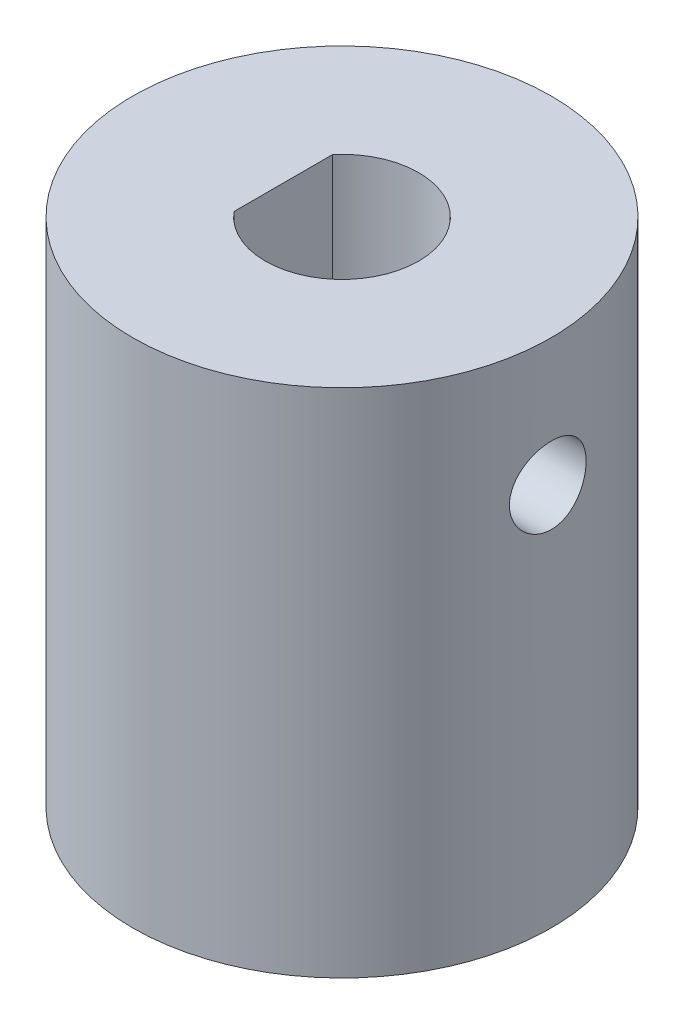
ISO-10303-21;
HEADER;
FILE_DESCRIPTION(('STEP AP214'),'2;1');
FILE_NAME('part.step','',(''),(''),'','','');
FILE_SCHEMA(('AUTOMOTIVE_DESIGN { 1 0 10303 214 1 1 1 1 }'));
ENDSEC;
DATA;
#1=APPLICATION_CONTEXT('core data for automotive mechanical design processes');
#2=APPLICATION_PROTOCOL_DEFINITION('international standard','automotive_design',2000,#1);
#3=PRODUCT_CONTEXT('',#1,'mechanical');
#4=PRODUCT('Part','Part','',(#3));
#5=PRODUCT_RELATED_PRODUCT_CATEGORY('part','',(#4));
#6=PRODUCT_DEFINITION_FORMATION('','',#4);
#7=PRODUCT_DEFINITION_CONTEXT('part definition',#1,'design');
#8=PRODUCT_DEFINITION('design','',#6,#7);
#9=PRODUCT_DEFINITION_SHAPE('','',#8);
#10=(LENGTH_UNIT() NAMED_UNIT(*) SI_UNIT(.MILLI.,.METRE.));
#11=(NAMED_UNIT(*) PLANE_ANGLE_UNIT() SI_UNIT($,.RADIAN.));
#12=(NAMED_UNIT(*) SI_UNIT($,.STERADIAN.) SOLID_ANGLE_UNIT());
#13=UNCERTAINTY_MEASURE_WITH_UNIT(LENGTH_MEASURE(1.E-05),#10,'distance_accuracy_value','');
#14=(GEOMETRIC_REPRESENTATION_CONTEXT(3) GLOBAL_UNCERTAINTY_ASSIGNED_CONTEXT((#13)) GLOBAL_UNIT_ASSIGNED_CONTEXT((#10,
#11,#12)) REPRESENTATION_CONTEXT('',''));
#15=CARTESIAN_POINT('',(0.,0.,0.));
#16=DIRECTION('',(0.,0.,1.));
#17=DIRECTION('',(1.,0.,0.));
#18=AXIS2_PLACEMENT_3D('',#15,#16,#17);
#19=CARTESIAN_POINT('',(0.,20.,0.));
#20=DIRECTION('',(0.,-1.,0.));
#21=DIRECTION('',(0.,0.,-1.));
#22=AXIS2_PLACEMENT_3D('',#19,#20,#21);
#23=CYLINDRICAL_SURFACE('',#22,8.1890069126629);
#24=CARTESIAN_POINT('',(0.,20.,0.));
#25=DIRECTION('',(0.,1.,0.));
#26=DIRECTION('',(0.,0.,1.));
#27=AXIS2_PLACEMENT_3D('',#24,#25,#26);
#28=CIRCLE('',#27,8.1890069126629);
#29=CARTESIAN_POINT('',(0.,20.,8.1890069126629));
#30=VERTEX_POINT('',#29);
#31=EDGE_CURVE('E84',#30,#30,#28,.T.);
#32=ORIENTED_EDGE('',*,*,#31,.F.);
#33=EDGE_LOOP('',(#32));
#34=FACE_BOUND('',#33,.T.);
#35=CARTESIAN_POINT('',(0.,0.,0.));
#36=DIRECTION('',(0.,1.,0.));
#37=DIRECTION('',(0.,0.,1.));
#38=AXIS2_PLACEMENT_3D('',#35,#36,#37);
#39=CIRCLE('',#38,8.1890069126629);
#40=CARTESIAN_POINT('',(0.,0.,8.1890069126629));
#41=VERTEX_POINT('',#40);
#42=EDGE_CURVE('E87',#41,#41,#39,.T.);
#43=ORIENTED_EDGE('',*,*,#42,.T.);
#44=EDGE_LOOP('',(#43));
#45=FACE_BOUND('',#44,.T.);
#46=CARTESIAN_POINT('',(-8.05045552845556,15.,1.5));
#47=CARTESIAN_POINT('',(-8.05045712508259,15.0834938156143,1.4999967617717));
#48=CARTESIAN_POINT('',(-8.05176853870894,15.1670300636327,1.49300513990406));
#49=CARTESIAN_POINT('',(-8.05686634931734,15.3317495697272,1.4652407751053));
#50=CARTESIAN_POINT('',(-8.06065488543688,15.4129307307125,1.44445612086685));
#51=CARTESIAN_POINT('',(-8.07026379045823,15.5705327738723,1.38976326790009));
#52=CARTESIAN_POINT('',(-8.07608230855931,15.6469579177234,1.3558670203884));
#53=CARTESIAN_POINT('',(-8.08909338794624,15.7930311217619,1.27594444054268));
#54=CARTESIAN_POINT('',(-8.09628583178107,15.862679760476,1.22991914494129));
#55=CARTESIAN_POINT('',(-8.11132982233989,15.9940563428632,1.1264619396305));
#56=CARTESIAN_POINT('',(-8.11918757044286,16.0556920738239,1.06891381680938));
#57=CARTESIAN_POINT('',(-8.13462196064732,16.1684903395025,0.944295708381804));
#58=CARTESIAN_POINT('',(-8.14219858466923,16.2196522015802,0.87722511170261));
#59=CARTESIAN_POINT('',(-8.15628331442015,16.3104022557995,0.73486198244097));
#60=CARTESIAN_POINT('',(-8.1627832648426,16.3499037419658,0.659513302848179));
#61=CARTESIAN_POINT('',(-8.17391295020838,16.4156534094499,0.503110300253054));
#62=CARTESIAN_POINT('',(-8.17854283188648,16.4419026306458,0.422056425494573));
#63=CARTESIAN_POINT('',(-8.18536692056306,16.4801181605587,0.25749885992804));
#64=CARTESIAN_POINT('',(-8.18758760043035,16.4922398184696,0.174032362073648));
#65=CARTESIAN_POINT('',(-8.18943425788382,16.5023399658799,0.00622277752115519));
#66=CARTESIAN_POINT('',(-8.18906044675426,16.5003196070446,-0.0781202372386139));
#67=CARTESIAN_POINT('',(-8.18578098641724,16.4823126494839,-0.244223994695151));
#68=CARTESIAN_POINT('',(-8.18290565840816,16.4664933039704,-0.326003553901673));
#69=CARTESIAN_POINT('',(-8.1749801954825,16.4216016988468,-0.485727469751366));
#70=CARTESIAN_POINT('',(-8.1699299840118,16.3925289727264,-0.563671691286156));
#71=CARTESIAN_POINT('',(-8.15817130484192,16.3217950337718,-0.714000173868226));
#72=CARTESIAN_POINT('',(-8.15145400709458,16.2800665169073,-0.786352047526514));
#73=CARTESIAN_POINT('',(-8.13710477696812,16.1852550435009,-0.92308926590461));
#74=CARTESIAN_POINT('',(-8.12947275569904,16.1321709830689,-0.987473835149089));
#75=CARTESIAN_POINT('',(-8.11400831391879,16.0152323038722,-1.10743919023639));
#76=CARTESIAN_POINT('',(-8.10617459531773,15.9512313868407,-1.16287729522729));
#77=CARTESIAN_POINT('',(-8.09129673862161,15.8147642945198,-1.26225347514702));
#78=CARTESIAN_POINT('',(-8.08425261106319,15.7422980062913,-1.30619139662293));
#79=CARTESIAN_POINT('',(-8.07174985721038,15.5907732147081,-1.38135788366981));
#80=CARTESIAN_POINT('',(-8.06629372476261,15.5117045906958,-1.41256648916948));
#81=CARTESIAN_POINT('',(-8.05762351420779,15.3493240106681,-1.4612166877625));
#82=CARTESIAN_POINT('',(-8.05440919452616,15.2660125128973,-1.47865976423639));
#83=CARTESIAN_POINT('',(-8.05063412373908,15.0987955403852,-1.49907705454895));
#84=CARTESIAN_POINT('',(-8.05003584479144,15.0149158744904,-1.50225591017226));
#85=CARTESIAN_POINT('',(-8.0514602723565,14.8478240523423,-1.49460239017643));
#86=CARTESIAN_POINT('',(-8.05348285547777,14.7646118648495,-1.48377067418173));
#87=CARTESIAN_POINT('',(-8.05988621764376,14.6018849099344,-1.44857890809767));
#88=CARTESIAN_POINT('',(-8.06424840605489,14.5223462913999,-1.42432546016269));
#89=CARTESIAN_POINT('',(-8.07482354515098,14.3684618514744,-1.36309152053184));
#90=CARTESIAN_POINT('',(-8.08103662677984,14.2941163979404,-1.32611012835186));
#91=CARTESIAN_POINT('',(-8.09469933246159,14.1518251332918,-1.23999647745459));
#92=CARTESIAN_POINT('',(-8.10216185476365,14.0839590654254,-1.19073453844537));
#93=CARTESIAN_POINT('',(-8.11744601502593,13.9573825709202,-1.08163370078844));
#94=CARTESIAN_POINT('',(-8.12526768369476,13.8986729290901,-1.02179389643542));
#95=CARTESIAN_POINT('',(-8.14050901925255,13.7913150533739,-0.892323545165104));
#96=CARTESIAN_POINT('',(-8.14792231223957,13.742804201772,-0.822578212085143));
#97=CARTESIAN_POINT('',(-8.16140549390728,13.6581889449898,-0.675808712874692));
#98=CARTESIAN_POINT('',(-8.16747543262113,13.6220840777215,-0.598784817986432));
#99=CARTESIAN_POINT('',(-8.17756051384598,13.5635131080834,-0.440030368578521));
#100=CARTESIAN_POINT('',(-8.18158594842773,13.5409785836098,-0.358325740104585));
#101=CARTESIAN_POINT('',(-8.18717228596062,13.5099691496396,-0.192211023691791));
#102=CARTESIAN_POINT('',(-8.18873343588041,13.5014928312363,-0.107801207729903));
#103=CARTESIAN_POINT('',(-8.18921070214651,13.4988876336528,0.0600084943477177));
#104=CARTESIAN_POINT('',(-8.18816513168698,13.5045509341977,0.14340511669388));
#105=CARTESIAN_POINT('',(-8.18362574648551,13.5296102812759,0.308037353841497));
#106=CARTESIAN_POINT('',(-8.18013195294657,13.5490062088768,0.389272987352023));
#107=CARTESIAN_POINT('',(-8.17108830458502,13.6008943078247,0.547173994655786));
#108=CARTESIAN_POINT('',(-8.16554177372683,13.6333653143485,0.623846525686286));
#109=CARTESIAN_POINT('',(-8.152994157933,13.7104573407877,0.770686339753857));
#110=CARTESIAN_POINT('',(-8.14599298155967,13.7550791245448,0.840853213450021));
#111=CARTESIAN_POINT('',(-8.13118836753238,13.8559260889736,0.973728060142116));
#112=CARTESIAN_POINT('',(-8.12337525222211,13.9123018734933,1.03632066539604));
#113=CARTESIAN_POINT('',(-8.10788967358951,14.0347431281641,1.15122951116567));
#114=CARTESIAN_POINT('',(-8.10021724372751,14.1008108706461,1.20354333501936));
#115=CARTESIAN_POINT('',(-8.08580843580313,14.24145250559,1.29683860628769));
#116=CARTESIAN_POINT('',(-8.07908085142835,14.3160958771223,1.3377167091771));
#117=CARTESIAN_POINT('',(-8.06742879793818,14.4712883631418,1.40628821789744));
#118=CARTESIAN_POINT('',(-8.06250260612164,14.5518317463842,1.43399422806801));
#119=CARTESIAN_POINT('',(-8.05605259568235,14.693858488865,1.46971966709668));
#120=CARTESIAN_POINT('',(-8.05396598446343,14.7545037447911,1.48105560617139));
#121=CARTESIAN_POINT('',(-8.05116687877529,14.8767583095955,1.49619687346074));
#122=CARTESIAN_POINT('',(-8.05045434987767,14.9383675942805,1.50000239035429));
#123=CARTESIAN_POINT('',(-8.05045552845556,15.,1.5));
#124=B_SPLINE_CURVE_WITH_KNOTS('',3,(#46,#47,#48,#49,#50,#51,#52,#53,#54,#55,#56,#57,#58,#59,
#60,#61,#62,#63,#64,#65,#66,#67,#68,#69,#70,#71,#72,#73,#74,#75,#76,#77,#78,#79,#80,#81,#82,#83,
#84,#85,#86,#87,#88,#89,#90,#91,#92,#93,#94,#95,#96,#97,#98,#99,#100,#101,#102,#103,#104,#105,
#106,#107,#108,#109,#110,#111,#112,#113,#114,#115,#116,#117,#118,#119,#120,#121,#122,#123),
.UNSPECIFIED.,.T.,.F.,(4,2,2,2,2,2,2,2,2,2,2,2,2,2,2,2,2,2,2,2,2,2,2,2,2,2,2,2,2,2,2,2,2,2,2,2,
2,2,4),(0.,0.250255939526254,0.500728275356629,0.750972841613708,1.00119602510382,
1.25408295696729,1.50698612434019,1.76172505069723,2.01644398510423,2.26833473926557,
2.52020498076042,2.76906414838135,3.01793207635834,3.26814741839374,3.51838709531706,
3.77229013933149,4.0261965711333,4.28049962169429,4.53477526468337,4.78539102867204,
5.03599499397951,5.28463652500905,5.53329565069386,5.78470089623965,6.03612767821493,
6.29075047743674,6.54536379164738,6.79868234811986,7.05197551559412,7.30156782780784,
7.55115797843633,7.80034572758294,8.04954914518698,8.3021669466382,8.55484407061273,
8.80973585232631,9.06438323541325,9.24911861914774,9.43384937417561),.UNSPECIFIED.);
#125=CARTESIAN_POINT('',(-8.05045552845556,15.,1.5));
#126=VERTEX_POINT('',#125);
#127=EDGE_CURVE('E81',#126,#126,#124,.T.);
#128=ORIENTED_EDGE('',*,*,#127,.F.);
#129=EDGE_LOOP('',(#128));
#130=FACE_BOUND('',#129,.T.);
#131=CARTESIAN_POINT('',(8.05045552845556,15.,1.5));
#132=CARTESIAN_POINT('',(8.05045712508259,14.9165061843857,1.4999967617717));
#133=CARTESIAN_POINT('',(8.05176853870894,14.8329699363673,1.49300513990406));
#134=CARTESIAN_POINT('',(8.05686634931734,14.6682504302728,1.4652407751053));
#135=CARTESIAN_POINT('',(8.06065488543688,14.5870692692875,1.44445612086685));
#136=CARTESIAN_POINT('',(8.07026379045823,14.4294672261277,1.38976326790009));
#137=CARTESIAN_POINT('',(8.07608230855931,14.3530420822766,1.3558670203884));
#138=CARTESIAN_POINT('',(8.08909338794624,14.2069688782381,1.27594444054268));
#139=CARTESIAN_POINT('',(8.09628583178107,14.137320239524,1.22991914494129));
#140=CARTESIAN_POINT('',(8.11132982233989,14.0059436571368,1.1264619396305));
#141=CARTESIAN_POINT('',(8.11918757044286,13.9443079261761,1.06891381680938));
#142=CARTESIAN_POINT('',(8.13462196064732,13.8315096604975,0.944295708381804));
#143=CARTESIAN_POINT('',(8.14219858466923,13.7803477984198,0.877225111702611));
#144=CARTESIAN_POINT('',(8.15628331442015,13.6895977442005,0.734861982440971));
#145=CARTESIAN_POINT('',(8.16278326484259,13.6500962580342,0.659513302848181));
#146=CARTESIAN_POINT('',(8.17391295020838,13.5843465905501,0.503110300253056));
#147=CARTESIAN_POINT('',(8.17854283188648,13.5580973693542,0.422056425494575));
#148=CARTESIAN_POINT('',(8.18536692056306,13.5198818394413,0.257498859928042));
#149=CARTESIAN_POINT('',(8.18758760043035,13.5077601815304,0.174032362073649));
#150=CARTESIAN_POINT('',(8.18943425788382,13.4976600341201,0.00622277752115572));
#151=CARTESIAN_POINT('',(8.18906044675426,13.4996803929554,-0.0781202372386137));
#152=CARTESIAN_POINT('',(8.18578098641724,13.5176873505161,-0.244223994695151));
#153=CARTESIAN_POINT('',(8.18290565840816,13.5335066960296,-0.326003553901673));
#154=CARTESIAN_POINT('',(8.1749801954825,13.5783983011532,-0.485727469751367));
#155=CARTESIAN_POINT('',(8.1699299840118,13.6074710272736,-0.563671691286157));
#156=CARTESIAN_POINT('',(8.15817130484192,13.6782049662282,-0.714000173868226));
#157=CARTESIAN_POINT('',(8.15145400709458,13.7199334830927,-0.786352047526514));
#158=CARTESIAN_POINT('',(8.13710477696812,13.8147449564991,-0.92308926590461));
#159=CARTESIAN_POINT('',(8.12947275569904,13.8678290169311,-0.98747383514909));
#160=CARTESIAN_POINT('',(8.11400831391879,13.9847676961278,-1.10743919023639));
#161=CARTESIAN_POINT('',(8.10617459531773,14.0487686131593,-1.16287729522729));
#162=CARTESIAN_POINT('',(8.09129673862161,14.1852357054802,-1.26225347514702));
#163=CARTESIAN_POINT('',(8.08425261106319,14.2577019937087,-1.30619139662293));
#164=CARTESIAN_POINT('',(8.07174985721038,14.4092267852919,-1.38135788366982));
#165=CARTESIAN_POINT('',(8.06629372476261,14.4882954093042,-1.41256648916948));
#166=CARTESIAN_POINT('',(8.05762351420779,14.6506759893319,-1.4612166877625));
#167=CARTESIAN_POINT('',(8.05440919452616,14.7339874871027,-1.47865976423639));
#168=CARTESIAN_POINT('',(8.05063412373908,14.9012044596148,-1.49907705454895));
#169=CARTESIAN_POINT('',(8.05003584479144,14.9850841255096,-1.50225591017226));
#170=CARTESIAN_POINT('',(8.0514602723565,15.1521759476577,-1.49460239017643));
#171=CARTESIAN_POINT('',(8.05348285547777,15.2353881351505,-1.48377067418172));
#172=CARTESIAN_POINT('',(8.05988621764376,15.3981150900656,-1.44857890809767));
#173=CARTESIAN_POINT('',(8.06424840605489,15.4776537086001,-1.42432546016269));
#174=CARTESIAN_POINT('',(8.07482354515098,15.6315381485256,-1.36309152053184));
#175=CARTESIAN_POINT('',(8.08103662677984,15.7058836020596,-1.32611012835186));
#176=CARTESIAN_POINT('',(8.09469933246159,15.8481748667082,-1.23999647745459));
#177=CARTESIAN_POINT('',(8.10216185476365,15.9160409345746,-1.19073453844537));
#178=CARTESIAN_POINT('',(8.11744601502593,16.0426174290798,-1.08163370078844));
#179=CARTESIAN_POINT('',(8.12526768369476,16.1013270709099,-1.02179389643542));
#180=CARTESIAN_POINT('',(8.14050901925255,16.2086849466261,-0.892323545165102));
#181=CARTESIAN_POINT('',(8.14792231223957,16.257195798228,-0.822578212085141));
#182=CARTESIAN_POINT('',(8.16140549390728,16.3418110550102,-0.675808712874691));
#183=CARTESIAN_POINT('',(8.16747543262113,16.3779159222785,-0.598784817986431));
#184=CARTESIAN_POINT('',(8.17756051384598,16.4364868919166,-0.440030368578522));
#185=CARTESIAN_POINT('',(8.18158594842773,16.4590214163902,-0.358325740104585));
#186=CARTESIAN_POINT('',(8.18717228596062,16.4900308503604,-0.192211023691791));
#187=CARTESIAN_POINT('',(8.18873343588041,16.4985071687637,-0.107801207729902));
#188=CARTESIAN_POINT('',(8.18921070214651,16.5011123663472,0.0600084943477179));
#189=CARTESIAN_POINT('',(8.18816513168698,16.4954490658023,0.14340511669388));
#190=CARTESIAN_POINT('',(8.18362574648551,16.4703897187241,0.308037353841497));
#191=CARTESIAN_POINT('',(8.18013195294657,16.4509937911232,0.389272987352023));
#192=CARTESIAN_POINT('',(8.17108830458502,16.3991056921753,0.547173994655786));
#193=CARTESIAN_POINT('',(8.16554177372683,16.3666346856515,0.623846525686286));
#194=CARTESIAN_POINT('',(8.152994157933,16.2895426592123,0.770686339753857));
#195=CARTESIAN_POINT('',(8.14599298155967,16.2449208754552,0.840853213450021));
#196=CARTESIAN_POINT('',(8.13118836753238,16.1440739110264,0.973728060142117));
#197=CARTESIAN_POINT('',(8.12337525222211,16.0876981265067,1.03632066539604));
#198=CARTESIAN_POINT('',(8.10788967358951,15.9652568718359,1.15122951116567));
#199=CARTESIAN_POINT('',(8.10021724372751,15.8991891293539,1.20354333501936));
#200=CARTESIAN_POINT('',(8.08580843580313,15.75854749441,1.29683860628769));
#201=CARTESIAN_POINT('',(8.07908085142835,15.6839041228777,1.33771670917709));
#202=CARTESIAN_POINT('',(8.06742879793818,15.5287116368582,1.40628821789744));
#203=CARTESIAN_POINT('',(8.06250260612164,15.4481682536158,1.43399422806801));
#204=CARTESIAN_POINT('',(8.05605259568235,15.306141511135,1.46971966709668));
#205=CARTESIAN_POINT('',(8.05396598446343,15.2454962552089,1.48105560617139));
#206=CARTESIAN_POINT('',(8.05116687877529,15.1232416904045,1.49619687346074));
#207=CARTESIAN_POINT('',(8.05045434987767,15.0616324057195,1.50000239035429));
#208=CARTESIAN_POINT('',(8.05045552845556,15.,1.5));
#209=B_SPLINE_CURVE_WITH_KNOTS('',3,(#131,#132,#133,#134,#135,#136,#137,#138,#139,#140,#141,
#142,#143,#144,#145,#146,#147,#148,#149,#150,#151,#152,#153,#154,#155,#156,#157,#158,#159,#160,
#161,#162,#163,#164,#165,#166,#167,#168,#169,#170,#171,#172,#173,#174,#175,#176,#177,#178,#179,
#180,#181,#182,#183,#184,#185,#186,#187,#188,#189,#190,#191,#192,#193,#194,#195,#196,#197,#198,
#199,#200,#201,#202,#203,#204,#205,#206,#207,#208),.UNSPECIFIED.,.T.,.F.,(4,2,2,2,2,2,2,2,2,2,2,
2,2,2,2,2,2,2,2,2,2,2,2,2,2,2,2,2,2,2,2,2,2,2,2,2,2,2,4),(0.,0.250255939526254,
0.500728275356629,0.750972841613708,1.00119602510381,1.25408295696729,1.50698612434018,
1.76172505069722,2.01644398510422,2.26833473926557,2.52020498076042,2.76906414838135,
3.01793207635834,3.26814741839374,3.51838709531706,3.77229013933149,4.0261965711333,
4.2804996216943,4.53477526468337,4.78539102867204,5.03599499397952,5.28463652500905,
5.53329565069386,5.78470089623965,6.03612767821494,6.29075047743675,6.54536379164738,
6.79868234811987,7.05197551559412,7.30156782780784,7.55115797843633,7.80034572758293,
8.04954914518698,8.3021669466382,8.55484407061273,8.80973585232631,9.06438323541325,
9.24911861914774,9.4338493741756),.UNSPECIFIED.);
#210=CARTESIAN_POINT('',(8.05045552845556,15.,1.5));
#211=VERTEX_POINT('',#210);
#212=EDGE_CURVE('E77',#211,#211,#209,.T.);
#213=ORIENTED_EDGE('',*,*,#212,.F.);
#214=EDGE_LOOP('',(#213));
#215=FACE_BOUND('',#214,.T.);
#216=ADVANCED_FACE('F36',(#34,#45,#130,#215),#23,.T.);
#217=CARTESIAN_POINT('',(0.,-10.,0.));
#218=DIRECTION('',(0.,1.,0.));
#219=DIRECTION('',(0.,0.,1.));
#220=AXIS2_PLACEMENT_3D('',#217,#218,#219);
#221=CYLINDRICAL_SURFACE('',#220,3.);
#222=CARTESIAN_POINT('',(0.,20.,0.));
#223=DIRECTION('',(0.,1.,0.));
#224=DIRECTION('',(0.,0.,1.));
#225=AXIS2_PLACEMENT_3D('',#222,#223,#224);
#226=CIRCLE('',#225,3.);
#227=CARTESIAN_POINT('',(-2.2951076558143,20.,1.93196295208335));
#228=VERTEX_POINT('',#227);
#229=CARTESIAN_POINT('',(-2.2951076558143,20.,-1.93196295208335));
#230=VERTEX_POINT('',#229);
#231=EDGE_CURVE('E61',#228,#230,#226,.T.);
#232=ORIENTED_EDGE('',*,*,#231,.T.);
#233=DIRECTION('',(0.,1.,0.));
#234=VECTOR('',#233,1.);
#235=CARTESIAN_POINT('',(-2.2951076558143,-10.,-1.93196295208335));
#236=LINE('',#235,#234);
#237=CARTESIAN_POINT('',(-2.2951076558143,10.,-1.93196295208335));
#238=VERTEX_POINT('',#237);
#239=EDGE_CURVE('E11',#230,#238,#236,.F.);
#240=ORIENTED_EDGE('',*,*,#239,.T.);
#241=CARTESIAN_POINT('',(0.,10.,0.));
#242=DIRECTION('',(0.,1.,0.));
#243=DIRECTION('',(0.,0.,1.));
#244=AXIS2_PLACEMENT_3D('',#241,#242,#243);
#245=CIRCLE('',#244,3.);
#246=CARTESIAN_POINT('',(-2.2951076558143,10.,1.93196295208335));
#247=VERTEX_POINT('',#246);
#248=EDGE_CURVE('E45',#247,#238,#245,.F.);
#249=ORIENTED_EDGE('',*,*,#248,.F.);
#250=DIRECTION('',(0.,1.,0.));
#251=VECTOR('',#250,1.);
#252=CARTESIAN_POINT('',(-2.2951076558143,10.,1.93196295208335));
#253=LINE('',#252,#251);
#254=EDGE_CURVE('E67',#247,#228,#253,.T.);
#255=ORIENTED_EDGE('',*,*,#254,.T.);
#256=EDGE_LOOP('',(#232,#240,#249,#255));
#257=FACE_BOUND('',#256,.T.);
#258=CARTESIAN_POINT('',(0.,0.,0.));
#259=DIRECTION('',(0.,1.,0.));
#260=DIRECTION('',(0.,0.,1.));
#261=AXIS2_PLACEMENT_3D('',#258,#259,#260);
#262=CIRCLE('',#261,3.);
#263=CARTESIAN_POINT('',(0.,0.,3.));
#264=VERTEX_POINT('',#263);
#265=EDGE_CURVE('E66',#264,#264,#262,.T.);
#266=ORIENTED_EDGE('',*,*,#265,.F.);
#267=EDGE_LOOP('',(#266));
#268=FACE_BOUND('',#267,.T.);
#269=CARTESIAN_POINT('',(2.59807621135332,15.,1.5));
#270=CARTESIAN_POINT('',(2.59808302092689,15.0781617122929,1.4999945446118));
#271=CARTESIAN_POINT('',(2.60165701781635,15.1564221172876,1.49384995609983));
#272=CARTESIAN_POINT('',(2.61543549678079,15.3105408970157,1.46958481484708));
#273=CARTESIAN_POINT('',(2.62565391083339,15.3863938725651,1.45143909683127));
#274=CARTESIAN_POINT('',(2.65124019908098,15.5331774965159,1.40414992304972));
#275=CARTESIAN_POINT('',(2.66658065209878,15.6041319787104,1.3750649287406));
#276=CARTESIAN_POINT('',(2.70063997225287,15.7401363029951,1.30690128806456));
#277=CARTESIAN_POINT('',(2.71935902214097,15.8051858253937,1.26782210105366));
#278=CARTESIAN_POINT('',(2.75995303586162,15.9334585928363,1.17699981079632));
#279=CARTESIAN_POINT('',(2.7819609545693,15.9960887035103,1.12447805421566));
#280=CARTESIAN_POINT('',(2.82557974178559,16.1121125826101,1.0098807114217));
#281=CARTESIAN_POINT('',(2.84719040746875,16.1655017438753,0.94780038867344));
#282=CARTESIAN_POINT('',(2.88932215429424,16.2650507267215,0.810734345121819));
#283=CARTESIAN_POINT('',(2.90967159627259,16.3104806517893,0.735160783518863));
#284=CARTESIAN_POINT('',(2.94526134149293,16.3877112798686,0.576235539899257));
#285=CARTESIAN_POINT('',(2.96050486775612,16.4195205842058,0.492888807207234));
#286=CARTESIAN_POINT('',(2.98320691866356,16.4662569919516,0.327067415888967));
#287=CARTESIAN_POINT('',(2.99114220331338,16.4822242895333,0.244952685733227));
#288=CARTESIAN_POINT('',(3.00011375769101,16.5002491780126,0.0788559430467727));
#289=CARTESIAN_POINT('',(3.00115420176885,16.5023151851936,-0.0051249087656075));
#290=CARTESIAN_POINT('',(2.99644472874675,16.4928799890445,-0.164748786635625));
#291=CARTESIAN_POINT('',(2.99127743838241,16.4825429767182,-0.240481798765187));
#292=CARTESIAN_POINT('',(2.97561367889621,16.450678734143,-0.388970657877483));
#293=CARTESIAN_POINT('',(2.96511681099591,16.4291506665357,-0.461726281640888));
#294=CARTESIAN_POINT('',(2.93957374931482,16.3753761508653,-0.60346408735433));
#295=CARTESIAN_POINT('',(2.92446662293799,16.3429855302419,-0.672380135272767));
#296=CARTESIAN_POINT('',(2.89106468980031,16.2686048756978,-0.803965202269993));
#297=CARTESIAN_POINT('',(2.87276874236226,16.2266114050465,-0.866631973257968));
#298=CARTESIAN_POINT('',(2.83266591598844,16.1296569727005,-0.990260491347293));
#299=CARTESIAN_POINT('',(2.81069063997263,16.073845457511,-1.05050111254404));
#300=CARTESIAN_POINT('',(2.76681510880218,15.9531154126047,-1.16115655544667));
#301=CARTESIAN_POINT('',(2.74491492398443,15.8881899415889,-1.21156381736135));
#302=CARTESIAN_POINT('',(2.70216234138727,15.7460277113639,-1.30425800196332));
#303=CARTESIAN_POINT('',(2.68146479986061,15.6682709654187,-1.34582597246708));
#304=CARTESIAN_POINT('',(2.64563175417864,15.5055934929615,-1.41497866950185));
#305=CARTESIAN_POINT('',(2.63049045069101,15.4206803504737,-1.44257798731633));
#306=CARTESIAN_POINT('',(2.60916953725552,15.2531782330758,-1.48077031653756));
#307=CARTESIAN_POINT('',(2.60237483772745,15.1709383214347,-1.49253768317996));
#308=CARTESIAN_POINT('',(2.59676879042414,15.0053979877252,-1.50227541991714));
#309=CARTESIAN_POINT('',(2.59795180333967,14.9220983563203,-1.50025553597254));
#310=CARTESIAN_POINT('',(2.60751504810877,14.7665191221319,-1.48355406501595));
#311=CARTESIAN_POINT('',(2.61509381259981,14.6940308233381,-1.4702817250687));
#312=CARTESIAN_POINT('',(2.63541032327012,14.5524483205936,-1.43354442694866));
#313=CARTESIAN_POINT('',(2.64814974007551,14.4833552238801,-1.41007616793542));
#314=CARTESIAN_POINT('',(2.67804333119485,14.346883003646,-1.35247138290733));
#315=CARTESIAN_POINT('',(2.69537464864595,14.2797314747197,-1.31789109553909));
#316=CARTESIAN_POINT('',(2.73234179245875,14.1517960926915,-1.23943059602371));
#317=CARTESIAN_POINT('',(2.75197880032721,14.0910155347301,-1.19554560649832));
#318=CARTESIAN_POINT('',(2.79431997684504,13.9695318487147,-1.09325575079828));
#319=CARTESIAN_POINT('',(2.81709874731433,13.9098042739235,-1.03371790847245));
#320=CARTESIAN_POINT('',(2.86101352466839,13.8008816430096,-0.905106743097434));
#321=CARTESIAN_POINT('',(2.88214897511564,13.7516901446542,-0.836030211983021));
#322=CARTESIAN_POINT('',(2.92112042536435,13.6641394110748,-0.687803043838136));
#323=CARTESIAN_POINT('',(2.93885462508044,13.6261003226836,-0.60843464636117));
#324=CARTESIAN_POINT('',(2.96825032438951,13.5642931442139,-0.443283546961624));
#325=CARTESIAN_POINT('',(2.9799171551456,13.5405125229505,-0.357506552088264));
#326=CARTESIAN_POINT('',(2.99501262272824,13.509947153738,-0.190469523495626));
#327=CARTESIAN_POINT('',(2.99909891862287,13.5018031861858,-0.109517165775686));
#328=CARTESIAN_POINT('',(3.00063195562697,13.4987351018184,0.0526889789268046));
#329=CARTESIAN_POINT('',(2.99808102100335,13.5038063572147,0.133942650442629));
#330=CARTESIAN_POINT('',(2.98700953256884,13.5261246101934,0.28880698847572));
#331=CARTESIAN_POINT('',(2.97889342001985,13.5425472738865,0.362568476716895));
#332=CARTESIAN_POINT('',(2.95788140495135,13.5859904989545,0.506168928275426));
#333=CARTESIAN_POINT('',(2.94498481699193,13.6130125801402,0.576007327433263));
#334=CARTESIAN_POINT('',(2.9148889612218,13.678090578249,0.713135109367326));
#335=CARTESIAN_POINT('',(2.89752925798199,13.7165689848118,0.780187714050068));
#336=CARTESIAN_POINT('',(2.86032199712739,13.8029368962886,0.907161962721036));
#337=CARTESIAN_POINT('',(2.84047329837541,13.8508307236735,0.96708031112236));
#338=CARTESIAN_POINT('',(2.79792915339941,13.9601957085341,1.08437100623534));
#339=CARTESIAN_POINT('',(2.77514698517547,14.0225437312158,1.14089652680891));
#340=CARTESIAN_POINT('',(2.73094614244279,14.1561760816947,1.24299493109201));
#341=CARTESIAN_POINT('',(2.70952868642798,14.2274682313015,1.28855812501509));
#342=CARTESIAN_POINT('',(2.66999407957374,14.3799549698714,1.36864661967848));
#343=CARTESIAN_POINT('',(2.65200261384405,14.4613912966931,1.40277759894141));
#344=CARTESIAN_POINT('',(2.62299234492527,14.6299986065097,1.45631806425962));
#345=CARTESIAN_POINT('',(2.61195024221553,14.717149333369,1.47577678676302));
#346=CARTESIAN_POINT('',(2.60293908902686,14.837708033478,1.49155051179662));
#347=CARTESIAN_POINT('',(2.60112193507728,14.8700518415968,1.49471415744578));
#348=CARTESIAN_POINT('',(2.59868903831625,14.9349247210234,1.49894010763495));
#349=CARTESIAN_POINT('',(2.59807337587664,14.9674538045788,1.50000227159981));
#350=CARTESIAN_POINT('',(2.59807621135332,15.,1.5));
#351=B_SPLINE_CURVE_WITH_KNOTS('',3,(#269,#270,#271,#272,#273,#274,#275,#276,#277,#278,#279,
#280,#281,#282,#283,#284,#285,#286,#287,#288,#289,#290,#291,#292,#293,#294,#295,#296,#297,#298,
#299,#300,#301,#302,#303,#304,#305,#306,#307,#308,#309,#310,#311,#312,#313,#314,#315,#316,#317,
#318,#319,#320,#321,#322,#323,#324,#325,#326,#327,#328,#329,#330,#331,#332,#333,#334,#335,#336,
#337,#338,#339,#340,#341,#342,#343,#344,#345,#346,#347,#348,#349,#350),.UNSPECIFIED.,.T.,.F.,(4,
2,2,2,2,2,2,2,2,2,2,2,2,2,2,2,2,2,2,2,2,2,2,2,2,2,2,2,2,2,2,2,2,2,2,2,2,2,2,2,4),(0.,
0.234348183892073,0.469189339237207,0.702792893878327,0.936409088167727,1.18929346874735,
1.44230356626557,1.71236838358145,1.98226240445836,2.23295227451903,2.4834903552906,
2.71224146226808,2.94100968776183,3.1729430209672,3.40495949025408,3.65890787185336,
3.91305072368878,4.18333262594173,4.45333161317557,4.70193436281318,4.95036139782559,
5.17161275136038,5.39293578654094,5.62450944609131,5.85620229330071,6.1171011537092,
6.37808797467303,6.64596272119449,6.91360169713157,7.1566840558423,7.39968130190958,
7.62666637307239,7.8536840026802,8.09041126079208,8.32724745151079,8.58765362775101,
8.84828914267731,9.11716123557908,9.38512699504141,9.48270202777964,9.58028358741811),.UNSPECIFIED.);
#352=CARTESIAN_POINT('',(2.59807621135332,15.,1.5));
#353=VERTEX_POINT('',#352);
#354=EDGE_CURVE('E131',#353,#353,#351,.T.);
#355=ORIENTED_EDGE('',*,*,#354,.F.);
#356=EDGE_LOOP('',(#355));
#357=FACE_BOUND('',#356,.T.);
#358=ADVANCED_FACE('F69',(#257,#268,#357),#221,.F.);
#359=CARTESIAN_POINT('',(0.,20.,0.));
#360=DIRECTION('',(0.,1.,0.));
#361=DIRECTION('',(0.,0.,1.));
#362=AXIS2_PLACEMENT_3D('',#359,#360,#361);
#363=PLANE('',#362);
#364=ORIENTED_EDGE('',*,*,#231,.F.);
#365=DIRECTION('',(0.,0.,-1.));
#366=VECTOR('',#365,1.);
#367=CARTESIAN_POINT('',(-2.2951076558143,20.,1.93196295208335));
#368=LINE('',#367,#366);
#369=EDGE_CURVE('E65',#228,#230,#368,.T.);
#370=ORIENTED_EDGE('',*,*,#369,.T.);
#371=EDGE_LOOP('',(#364,#370));
#372=FACE_BOUND('',#371,.T.);
#373=ORIENTED_EDGE('',*,*,#31,.T.);
#374=EDGE_LOOP('',(#373));
#375=FACE_BOUND('',#374,.T.);
#376=ADVANCED_FACE('F62',(#372,#375),#363,.T.);
#377=CARTESIAN_POINT('',(0.,0.,0.));
#378=DIRECTION('',(0.,1.,0.));
#379=DIRECTION('',(0.,0.,1.));
#380=AXIS2_PLACEMENT_3D('',#377,#378,#379);
#381=PLANE('',#380);
#382=ORIENTED_EDGE('',*,*,#265,.T.);
#383=EDGE_LOOP('',(#382));
#384=FACE_BOUND('',#383,.T.);
#385=ORIENTED_EDGE('',*,*,#42,.F.);
#386=EDGE_LOOP('',(#385));
#387=FACE_BOUND('',#386,.T.);
#388=ADVANCED_FACE('F104',(#384,#387),#381,.F.);
#389=CARTESIAN_POINT('',(-2.2951076558143,10.,1.93196295208335));
#390=DIRECTION('',(1.,0.,0.));
#391=DIRECTION('',(0.,0.,-1.));
#392=AXIS2_PLACEMENT_3D('',#389,#390,#391);
#393=PLANE('',#392);
#394=CARTESIAN_POINT('',(-2.2951076558143,15.,0.));
#395=DIRECTION('',(1.,0.,0.));
#396=DIRECTION('',(0.,0.,-1.));
#397=AXIS2_PLACEMENT_3D('',#394,#395,#396);
#398=CIRCLE('',#397,1.5);
#399=CARTESIAN_POINT('',(-2.2951076558143,15.,-1.5));
#400=VERTEX_POINT('',#399);
#401=EDGE_CURVE('E40',#400,#400,#398,.F.);
#402=ORIENTED_EDGE('',*,*,#401,.T.);
#403=EDGE_LOOP('',(#402));
#404=FACE_BOUND('',#403,.T.);
#405=ORIENTED_EDGE('',*,*,#239,.F.);
#406=ORIENTED_EDGE('',*,*,#369,.F.);
#407=ORIENTED_EDGE('',*,*,#254,.F.);
#408=DIRECTION('',(0.,0.,-1.));
#409=VECTOR('',#408,1.);
#410=CARTESIAN_POINT('',(-2.2951076558143,10.,1.93196295208335));
#411=LINE('',#410,#409);
#412=EDGE_CURVE('E74',#247,#238,#411,.T.);
#413=ORIENTED_EDGE('',*,*,#412,.T.);
#414=EDGE_LOOP('',(#405,#406,#407,#413));
#415=FACE_BOUND('',#414,.T.);
#416=ADVANCED_FACE('F76',(#404,#415),#393,.T.);
#417=CARTESIAN_POINT('',(0.,10.,0.));
#418=DIRECTION('',(0.,1.,0.));
#419=DIRECTION('',(0.,0.,1.));
#420=AXIS2_PLACEMENT_3D('',#417,#418,#419);
#421=PLANE('',#420);
#422=ORIENTED_EDGE('',*,*,#412,.F.);
#423=ORIENTED_EDGE('',*,*,#248,.T.);
#424=EDGE_LOOP('',(#422,#423));
#425=FACE_BOUND('',#424,.T.);
#426=ADVANCED_FACE('F93',(#425),#421,.F.);
#427=CARTESIAN_POINT('',(10.,15.,0.));
#428=DIRECTION('',(-1.,0.,0.));
#429=DIRECTION('',(0.,0.,1.));
#430=AXIS2_PLACEMENT_3D('',#427,#428,#429);
#431=CYLINDRICAL_SURFACE('',#430,1.5);
#432=ORIENTED_EDGE('',*,*,#401,.F.);
#433=EDGE_LOOP('',(#432));
#434=FACE_BOUND('',#433,.T.);
#435=ORIENTED_EDGE('',*,*,#127,.T.);
#436=EDGE_LOOP('',(#435));
#437=FACE_BOUND('',#436,.T.);
#438=ADVANCED_FACE('F95',(#434,#437),#431,.F.);
#439=ORIENTED_EDGE('',*,*,#354,.T.);
#440=EDGE_LOOP('',(#439));
#441=FACE_BOUND('',#440,.T.);
#442=ORIENTED_EDGE('',*,*,#212,.T.);
#443=EDGE_LOOP('',(#442));
#444=FACE_BOUND('',#443,.T.);
#445=ADVANCED_FACE('F101',(#441,#444),#431,.F.);
#446=CLOSED_SHELL('',(#216,#358,#376,#388,#416,#426,#438,#445));
#447=MANIFOLD_SOLID_BREP('B2',#446);
#448=ADVANCED_BREP_SHAPE_REPRESENTATION('',(#18,#447),#14);
#449=SHAPE_DEFINITION_REPRESENTATION(#9,#448);
ENDSEC;
END-ISO-10303-21;
